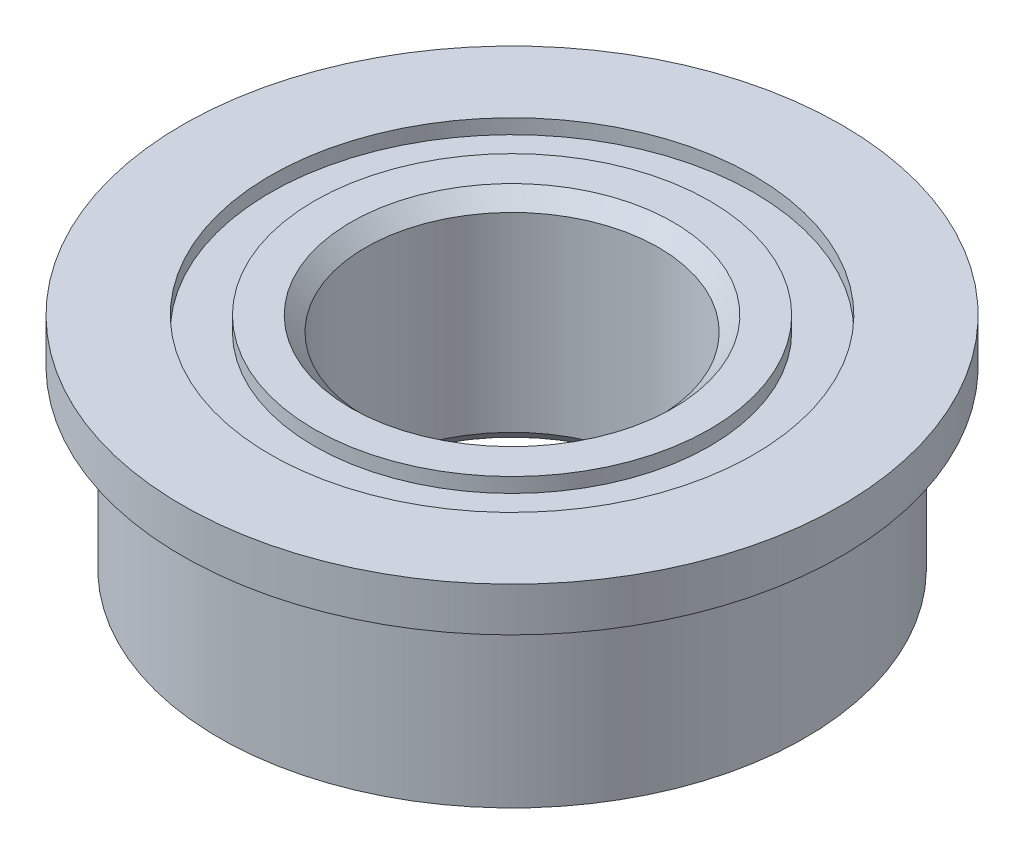
ISO-10303-21;
HEADER;
FILE_DESCRIPTION(('STEP AP214'),'2;1');
FILE_NAME('part.step','',(''),(''),'','','');
FILE_SCHEMA(('AUTOMOTIVE_DESIGN { 1 0 10303 214 1 1 1 1 }'));
ENDSEC;
DATA;
#1=APPLICATION_CONTEXT('core data for automotive mechanical design processes');
#2=APPLICATION_PROTOCOL_DEFINITION('international standard','automotive_design',2000,#1);
#3=PRODUCT_CONTEXT('',#1,'mechanical');
#4=PRODUCT('Part','Part','',(#3));
#5=PRODUCT_RELATED_PRODUCT_CATEGORY('part','',(#4));
#6=PRODUCT_DEFINITION_FORMATION('','',#4);
#7=PRODUCT_DEFINITION_CONTEXT('part definition',#1,'design');
#8=PRODUCT_DEFINITION('design','',#6,#7);
#9=PRODUCT_DEFINITION_SHAPE('','',#8);
#10=(LENGTH_UNIT() NAMED_UNIT(*) SI_UNIT(.MILLI.,.METRE.));
#11=(NAMED_UNIT(*) PLANE_ANGLE_UNIT() SI_UNIT($,.RADIAN.));
#12=(NAMED_UNIT(*) SI_UNIT($,.STERADIAN.) SOLID_ANGLE_UNIT());
#13=UNCERTAINTY_MEASURE_WITH_UNIT(LENGTH_MEASURE(1.E-05),#10,'distance_accuracy_value','');
#14=(GEOMETRIC_REPRESENTATION_CONTEXT(3) GLOBAL_UNCERTAINTY_ASSIGNED_CONTEXT((#13)) GLOBAL_UNIT_ASSIGNED_CONTEXT((#10,
#11,#12)) REPRESENTATION_CONTEXT('',''));
#15=CARTESIAN_POINT('',(0.,0.,0.));
#16=DIRECTION('',(0.,0.,1.));
#17=DIRECTION('',(1.,0.,0.));
#18=AXIS2_PLACEMENT_3D('',#15,#16,#17);
#19=CARTESIAN_POINT('',(4.,0.,0.));
#20=DIRECTION('',(0.,-1.,0.));
#21=DIRECTION('',(0.,0.,-1.));
#22=AXIS2_PLACEMENT_3D('',#19,#20,#21);
#23=PLANE('',#22);
#24=CARTESIAN_POINT('',(0.,0.,0.));
#25=DIRECTION('',(0.,-1.,0.));
#26=DIRECTION('',(0.,0.,-1.));
#27=AXIS2_PLACEMENT_3D('',#24,#25,#26);
#28=CIRCLE('',#27,4.5);
#29=CARTESIAN_POINT('',(0.,0.,-4.5));
#30=VERTEX_POINT('',#29);
#31=EDGE_CURVE('E48',#30,#30,#28,.T.);
#32=ORIENTED_EDGE('',*,*,#31,.T.);
#33=EDGE_LOOP('',(#32));
#34=FACE_BOUND('',#33,.T.);
#35=CARTESIAN_POINT('',(0.,0.,0.));
#36=DIRECTION('',(0.,-1.,0.));
#37=DIRECTION('',(0.,0.,-1.));
#38=AXIS2_PLACEMENT_3D('',#35,#36,#37);
#39=CIRCLE('',#38,4.);
#40=CARTESIAN_POINT('',(0.,0.,-4.));
#41=VERTEX_POINT('',#40);
#42=EDGE_CURVE('E81',#41,#41,#39,.T.);
#43=ORIENTED_EDGE('',*,*,#42,.F.);
#44=EDGE_LOOP('',(#43));
#45=FACE_BOUND('',#44,.T.);
#46=ADVANCED_FACE('F28',(#34,#45),#23,.T.);
#47=CARTESIAN_POINT('',(0.,0.,0.));
#48=DIRECTION('',(0.,-1.,0.));
#49=DIRECTION('',(0.,0.,-1.));
#50=AXIS2_PLACEMENT_3D('',#47,#48,#49);
#51=CYLINDRICAL_SURFACE('',#50,4.5);
#52=CARTESIAN_POINT('',(0.,0.6,0.));
#53=DIRECTION('',(0.,-1.,0.));
#54=DIRECTION('',(0.,0.,-1.));
#55=AXIS2_PLACEMENT_3D('',#52,#53,#54);
#56=CIRCLE('',#55,4.5);
#57=CARTESIAN_POINT('',(0.,0.6,-4.5));
#58=VERTEX_POINT('',#57);
#59=EDGE_CURVE('E51',#58,#58,#56,.T.);
#60=ORIENTED_EDGE('',*,*,#59,.T.);
#61=EDGE_LOOP('',(#60));
#62=FACE_BOUND('',#61,.T.);
#63=ORIENTED_EDGE('',*,*,#31,.F.);
#64=EDGE_LOOP('',(#63));
#65=FACE_BOUND('',#64,.T.);
#66=ADVANCED_FACE('F89',(#62,#65),#51,.T.);
#67=CARTESIAN_POINT('',(4.5,0.6,0.));
#68=DIRECTION('',(0.,1.,0.));
#69=DIRECTION('',(0.,0.,1.));
#70=AXIS2_PLACEMENT_3D('',#67,#68,#69);
#71=PLANE('',#70);
#72=CARTESIAN_POINT('',(0.,0.6,0.));
#73=DIRECTION('',(0.,-1.,0.));
#74=DIRECTION('',(0.,0.,-1.));
#75=AXIS2_PLACEMENT_3D('',#72,#73,#74);
#76=CIRCLE('',#75,3.3);
#77=CARTESIAN_POINT('',(0.,0.6,-3.3));
#78=VERTEX_POINT('',#77);
#79=EDGE_CURVE('E54',#78,#78,#76,.T.);
#80=ORIENTED_EDGE('',*,*,#79,.T.);
#81=EDGE_LOOP('',(#80));
#82=FACE_BOUND('',#81,.T.);
#83=ORIENTED_EDGE('',*,*,#59,.F.);
#84=EDGE_LOOP('',(#83));
#85=FACE_BOUND('',#84,.T.);
#86=ADVANCED_FACE('F95',(#82,#85),#71,.T.);
#87=CARTESIAN_POINT('',(0.,0.,0.));
#88=DIRECTION('',(0.,-1.,0.));
#89=DIRECTION('',(0.,0.,-1.));
#90=AXIS2_PLACEMENT_3D('',#87,#88,#89);
#91=CYLINDRICAL_SURFACE('',#90,3.3);
#92=CARTESIAN_POINT('',(0.,0.4,0.));
#93=DIRECTION('',(0.,-1.,0.));
#94=DIRECTION('',(0.,0.,-1.));
#95=AXIS2_PLACEMENT_3D('',#92,#93,#94);
#96=CIRCLE('',#95,3.3);
#97=CARTESIAN_POINT('',(0.,0.4,-3.3));
#98=VERTEX_POINT('',#97);
#99=EDGE_CURVE('E57',#98,#98,#96,.T.);
#100=ORIENTED_EDGE('',*,*,#99,.T.);
#101=EDGE_LOOP('',(#100));
#102=FACE_BOUND('',#101,.T.);
#103=ORIENTED_EDGE('',*,*,#79,.F.);
#104=EDGE_LOOP('',(#103));
#105=FACE_BOUND('',#104,.T.);
#106=ADVANCED_FACE('F128',(#102,#105),#91,.F.);
#107=CARTESIAN_POINT('',(3.3,0.4,0.));
#108=DIRECTION('',(0.,1.,0.));
#109=DIRECTION('',(0.,0.,1.));
#110=AXIS2_PLACEMENT_3D('',#107,#108,#109);
#111=PLANE('',#110);
#112=CARTESIAN_POINT('',(0.,0.4,0.));
#113=DIRECTION('',(0.,-1.,0.));
#114=DIRECTION('',(0.,0.,-1.));
#115=AXIS2_PLACEMENT_3D('',#112,#113,#114);
#116=CIRCLE('',#115,2.7);
#117=CARTESIAN_POINT('',(0.,0.4,-2.7));
#118=VERTEX_POINT('',#117);
#119=EDGE_CURVE('E60',#118,#118,#116,.T.);
#120=ORIENTED_EDGE('',*,*,#119,.T.);
#121=EDGE_LOOP('',(#120));
#122=FACE_BOUND('',#121,.T.);
#123=ORIENTED_EDGE('',*,*,#99,.F.);
#124=EDGE_LOOP('',(#123));
#125=FACE_BOUND('',#124,.T.);
#126=ADVANCED_FACE('F122',(#122,#125),#111,.T.);
#127=CARTESIAN_POINT('',(0.,0.,0.));
#128=DIRECTION('',(0.,-1.,0.));
#129=DIRECTION('',(0.,0.,-1.));
#130=AXIS2_PLACEMENT_3D('',#127,#128,#129);
#131=CYLINDRICAL_SURFACE('',#130,2.7);
#132=CARTESIAN_POINT('',(0.,0.6,0.));
#133=DIRECTION('',(0.,-1.,0.));
#134=DIRECTION('',(0.,0.,-1.));
#135=AXIS2_PLACEMENT_3D('',#132,#133,#134);
#136=CIRCLE('',#135,2.7);
#137=CARTESIAN_POINT('',(0.,0.6,-2.7));
#138=VERTEX_POINT('',#137);
#139=EDGE_CURVE('E63',#138,#138,#136,.T.);
#140=ORIENTED_EDGE('',*,*,#139,.T.);
#141=EDGE_LOOP('',(#140));
#142=FACE_BOUND('',#141,.T.);
#143=ORIENTED_EDGE('',*,*,#119,.F.);
#144=EDGE_LOOP('',(#143));
#145=FACE_BOUND('',#144,.T.);
#146=ADVANCED_FACE('F116',(#142,#145),#131,.T.);
#147=CARTESIAN_POINT('',(2.,0.599999999999999,0.));
#148=DIRECTION('',(0.,1.,0.));
#149=DIRECTION('',(0.,0.,1.));
#150=AXIS2_PLACEMENT_3D('',#147,#148,#149);
#151=PLANE('',#150);
#152=CARTESIAN_POINT('',(0.,0.599999999999999,0.));
#153=DIRECTION('',(0.,1.,0.));
#154=DIRECTION('',(0.,0.,1.));
#155=AXIS2_PLACEMENT_3D('',#152,#153,#154);
#156=CIRCLE('',#155,2.2);
#157=CARTESIAN_POINT('',(0.,0.599999999999999,2.2));
#158=VERTEX_POINT('',#157);
#159=EDGE_CURVE('E43',#158,#158,#156,.F.);
#160=ORIENTED_EDGE('',*,*,#159,.T.);
#161=EDGE_LOOP('',(#160));
#162=FACE_BOUND('',#161,.T.);
#163=ORIENTED_EDGE('',*,*,#139,.F.);
#164=EDGE_LOOP('',(#163));
#165=FACE_BOUND('',#164,.T.);
#166=ADVANCED_FACE('F112',(#162,#165),#151,.T.);
#167=CARTESIAN_POINT('',(0.,0.,0.));
#168=DIRECTION('',(0.,-1.,0.));
#169=DIRECTION('',(0.,0.,-1.));
#170=AXIS2_PLACEMENT_3D('',#167,#168,#169);
#171=CYLINDRICAL_SURFACE('',#170,2.);
#172=CARTESIAN_POINT('',(0.,0.399999999999997,0.));
#173=DIRECTION('',(0.,1.,0.));
#174=DIRECTION('',(0.,0.,1.));
#175=AXIS2_PLACEMENT_3D('',#172,#173,#174);
#176=CIRCLE('',#175,2.);
#177=CARTESIAN_POINT('',(0.,0.399999999999997,2.));
#178=VERTEX_POINT('',#177);
#179=EDGE_CURVE('E35',#178,#178,#176,.T.);
#180=ORIENTED_EDGE('',*,*,#179,.T.);
#181=EDGE_LOOP('',(#180));
#182=FACE_BOUND('',#181,.T.);
#183=CARTESIAN_POINT('',(0.,-2.2,0.));
#184=DIRECTION('',(0.,-1.,0.));
#185=DIRECTION('',(0.,0.,-1.));
#186=AXIS2_PLACEMENT_3D('',#183,#184,#185);
#187=CIRCLE('',#186,2.);
#188=CARTESIAN_POINT('',(0.,-2.2,-2.));
#189=VERTEX_POINT('',#188);
#190=EDGE_CURVE('E39',#189,#189,#187,.T.);
#191=ORIENTED_EDGE('',*,*,#190,.T.);
#192=EDGE_LOOP('',(#191));
#193=FACE_BOUND('',#192,.T.);
#194=ADVANCED_FACE('F115',(#182,#193),#171,.F.);
#195=CARTESIAN_POINT('',(2.,-2.4,0.));
#196=DIRECTION('',(0.,-1.,0.));
#197=DIRECTION('',(0.,0.,-1.));
#198=AXIS2_PLACEMENT_3D('',#195,#196,#197);
#199=PLANE('',#198);
#200=CARTESIAN_POINT('',(0.,-2.4,0.));
#201=DIRECTION('',(0.,-1.,0.));
#202=DIRECTION('',(0.,0.,-1.));
#203=AXIS2_PLACEMENT_3D('',#200,#201,#202);
#204=CIRCLE('',#203,2.2);
#205=CARTESIAN_POINT('',(0.,-2.4,-2.2));
#206=VERTEX_POINT('',#205);
#207=EDGE_CURVE('E10',#206,#206,#204,.F.);
#208=ORIENTED_EDGE('',*,*,#207,.T.);
#209=EDGE_LOOP('',(#208));
#210=FACE_BOUND('',#209,.T.);
#211=CARTESIAN_POINT('',(0.,-2.4,0.));
#212=DIRECTION('',(0.,-1.,0.));
#213=DIRECTION('',(0.,0.,-1.));
#214=AXIS2_PLACEMENT_3D('',#211,#212,#213);
#215=CIRCLE('',#214,2.7);
#216=CARTESIAN_POINT('',(0.,-2.4,-2.7));
#217=VERTEX_POINT('',#216);
#218=EDGE_CURVE('E66',#217,#217,#215,.T.);
#219=ORIENTED_EDGE('',*,*,#218,.T.);
#220=EDGE_LOOP('',(#219));
#221=FACE_BOUND('',#220,.T.);
#222=ADVANCED_FACE('F147',(#210,#221),#199,.T.);
#223=CARTESIAN_POINT('',(0.,0.,0.));
#224=DIRECTION('',(0.,-1.,0.));
#225=DIRECTION('',(0.,0.,-1.));
#226=AXIS2_PLACEMENT_3D('',#223,#224,#225);
#227=CYLINDRICAL_SURFACE('',#226,2.7);
#228=CARTESIAN_POINT('',(0.,-2.2,0.));
#229=DIRECTION('',(0.,-1.,0.));
#230=DIRECTION('',(0.,0.,-1.));
#231=AXIS2_PLACEMENT_3D('',#228,#229,#230);
#232=CIRCLE('',#231,2.7);
#233=CARTESIAN_POINT('',(0.,-2.2,-2.7));
#234=VERTEX_POINT('',#233);
#235=EDGE_CURVE('E69',#234,#234,#232,.T.);
#236=ORIENTED_EDGE('',*,*,#235,.T.);
#237=EDGE_LOOP('',(#236));
#238=FACE_BOUND('',#237,.T.);
#239=ORIENTED_EDGE('',*,*,#218,.F.);
#240=EDGE_LOOP('',(#239));
#241=FACE_BOUND('',#240,.T.);
#242=ADVANCED_FACE('F150',(#238,#241),#227,.T.);
#243=CARTESIAN_POINT('',(2.7,-2.2,0.));
#244=DIRECTION('',(0.,-1.,0.));
#245=DIRECTION('',(0.,0.,-1.));
#246=AXIS2_PLACEMENT_3D('',#243,#244,#245);
#247=PLANE('',#246);
#248=CARTESIAN_POINT('',(0.,-2.2,0.));
#249=DIRECTION('',(0.,-1.,0.));
#250=DIRECTION('',(0.,0.,-1.));
#251=AXIS2_PLACEMENT_3D('',#248,#249,#250);
#252=CIRCLE('',#251,3.3);
#253=CARTESIAN_POINT('',(0.,-2.2,-3.3));
#254=VERTEX_POINT('',#253);
#255=EDGE_CURVE('E72',#254,#254,#252,.T.);
#256=ORIENTED_EDGE('',*,*,#255,.T.);
#257=EDGE_LOOP('',(#256));
#258=FACE_BOUND('',#257,.T.);
#259=ORIENTED_EDGE('',*,*,#235,.F.);
#260=EDGE_LOOP('',(#259));
#261=FACE_BOUND('',#260,.T.);
#262=ADVANCED_FACE('F153',(#258,#261),#247,.T.);
#263=CARTESIAN_POINT('',(0.,0.,0.));
#264=DIRECTION('',(0.,-1.,0.));
#265=DIRECTION('',(0.,0.,-1.));
#266=AXIS2_PLACEMENT_3D('',#263,#264,#265);
#267=CYLINDRICAL_SURFACE('',#266,3.3);
#268=CARTESIAN_POINT('',(0.,-2.4,0.));
#269=DIRECTION('',(0.,-1.,0.));
#270=DIRECTION('',(0.,0.,-1.));
#271=AXIS2_PLACEMENT_3D('',#268,#269,#270);
#272=CIRCLE('',#271,3.3);
#273=CARTESIAN_POINT('',(0.,-2.4,-3.3));
#274=VERTEX_POINT('',#273);
#275=EDGE_CURVE('E75',#274,#274,#272,.T.);
#276=ORIENTED_EDGE('',*,*,#275,.T.);
#277=EDGE_LOOP('',(#276));
#278=FACE_BOUND('',#277,.T.);
#279=ORIENTED_EDGE('',*,*,#255,.F.);
#280=EDGE_LOOP('',(#279));
#281=FACE_BOUND('',#280,.T.);
#282=ADVANCED_FACE('F157',(#278,#281),#267,.F.);
#283=CARTESIAN_POINT('',(3.3,-2.4,0.));
#284=DIRECTION('',(0.,-1.,0.));
#285=DIRECTION('',(0.,0.,-1.));
#286=AXIS2_PLACEMENT_3D('',#283,#284,#285);
#287=PLANE('',#286);
#288=CARTESIAN_POINT('',(0.,-2.4,0.));
#289=DIRECTION('',(0.,-1.,0.));
#290=DIRECTION('',(0.,0.,-1.));
#291=AXIS2_PLACEMENT_3D('',#288,#289,#290);
#292=CIRCLE('',#291,4.);
#293=CARTESIAN_POINT('',(0.,-2.4,-4.));
#294=VERTEX_POINT('',#293);
#295=EDGE_CURVE('E78',#294,#294,#292,.T.);
#296=ORIENTED_EDGE('',*,*,#295,.T.);
#297=EDGE_LOOP('',(#296));
#298=FACE_BOUND('',#297,.T.);
#299=ORIENTED_EDGE('',*,*,#275,.F.);
#300=EDGE_LOOP('',(#299));
#301=FACE_BOUND('',#300,.T.);
#302=ADVANCED_FACE('F107',(#298,#301),#287,.T.);
#303=CARTESIAN_POINT('',(0.,0.,0.));
#304=DIRECTION('',(0.,-1.,0.));
#305=DIRECTION('',(0.,0.,-1.));
#306=AXIS2_PLACEMENT_3D('',#303,#304,#305);
#307=CYLINDRICAL_SURFACE('',#306,4.);
#308=ORIENTED_EDGE('',*,*,#42,.T.);
#309=EDGE_LOOP('',(#308));
#310=FACE_BOUND('',#309,.T.);
#311=ORIENTED_EDGE('',*,*,#295,.F.);
#312=EDGE_LOOP('',(#311));
#313=FACE_BOUND('',#312,.T.);
#314=ADVANCED_FACE('F85',(#310,#313),#307,.T.);
#315=CARTESIAN_POINT('',(0.,0.599999999999999,0.));
#316=DIRECTION('',(0.,1.,0.));
#317=DIRECTION('',(0.,0.,1.));
#318=AXIS2_PLACEMENT_3D('',#315,#316,#317);
#319=CONICAL_SURFACE('',#318,2.2,0.785398163397446);
#320=ORIENTED_EDGE('',*,*,#179,.F.);
#321=EDGE_LOOP('',(#320));
#322=FACE_BOUND('',#321,.T.);
#323=ORIENTED_EDGE('',*,*,#159,.F.);
#324=EDGE_LOOP('',(#323));
#325=FACE_BOUND('',#324,.T.);
#326=ADVANCED_FACE('F99',(#322,#325),#319,.F.);
#327=CARTESIAN_POINT('',(0.,-2.2,0.));
#328=DIRECTION('',(0.,-1.,0.));
#329=DIRECTION('',(0.,0.,-1.));
#330=AXIS2_PLACEMENT_3D('',#327,#328,#329);
#331=CONICAL_SURFACE('',#330,2.,0.785398163397456);
#332=ORIENTED_EDGE('',*,*,#207,.F.);
#333=EDGE_LOOP('',(#332));
#334=FACE_BOUND('',#333,.T.);
#335=ORIENTED_EDGE('',*,*,#190,.F.);
#336=EDGE_LOOP('',(#335));
#337=FACE_BOUND('',#336,.T.);
#338=ADVANCED_FACE('F30',(#334,#337),#331,.F.);
#339=CLOSED_SHELL('',(#46,#66,#86,#106,#126,#146,#166,#194,#222,#242,#262,#282,#302,#314,#326,#338));
#340=MANIFOLD_SOLID_BREP('B2',#339);
#341=ADVANCED_BREP_SHAPE_REPRESENTATION('',(#18,#340),#14);
#342=SHAPE_DEFINITION_REPRESENTATION(#9,#341);
ENDSEC;
END-ISO-10303-21;
